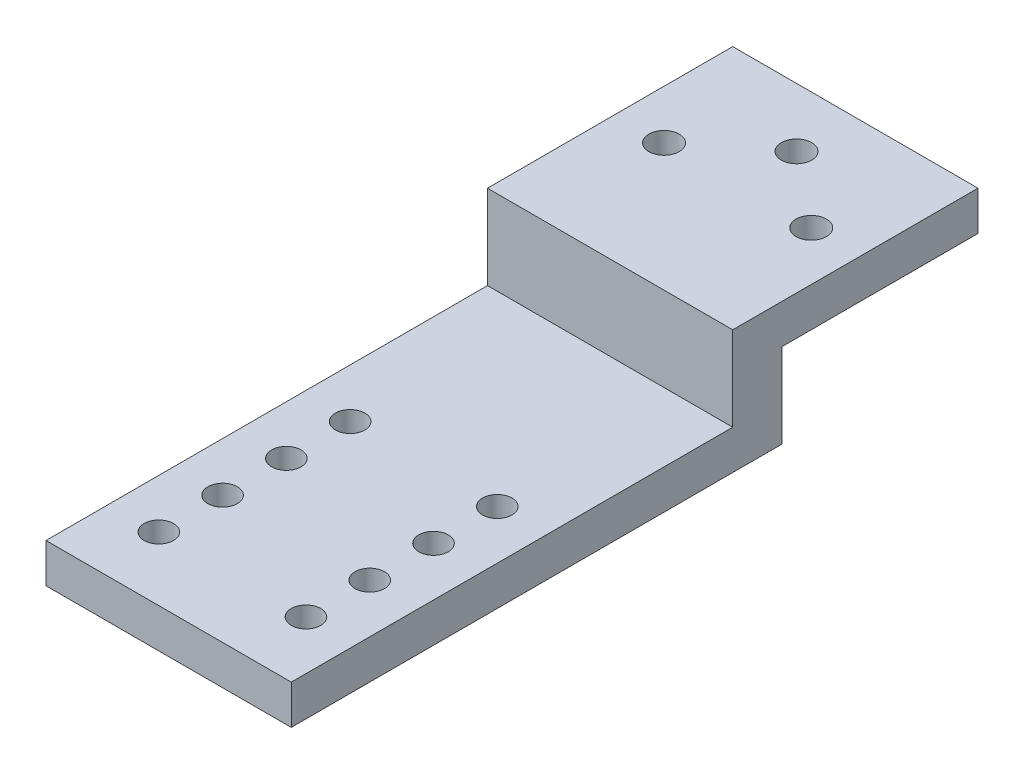
ISO-10303-21;
HEADER;
FILE_DESCRIPTION(('STEP AP214'),'2;1');
FILE_NAME('part.step','',(''),(''),'','','');
FILE_SCHEMA(('AUTOMOTIVE_DESIGN { 1 0 10303 214 1 1 1 1 }'));
ENDSEC;
DATA;
#1=APPLICATION_CONTEXT('core data for automotive mechanical design processes');
#2=APPLICATION_PROTOCOL_DEFINITION('international standard','automotive_design',2000,#1);
#3=PRODUCT_CONTEXT('',#1,'mechanical');
#4=PRODUCT('Part','Part','',(#3));
#5=PRODUCT_RELATED_PRODUCT_CATEGORY('part','',(#4));
#6=PRODUCT_DEFINITION_FORMATION('','',#4);
#7=PRODUCT_DEFINITION_CONTEXT('part definition',#1,'design');
#8=PRODUCT_DEFINITION('design','',#6,#7);
#9=PRODUCT_DEFINITION_SHAPE('','',#8);
#10=(LENGTH_UNIT() NAMED_UNIT(*) SI_UNIT(.MILLI.,.METRE.));
#11=(NAMED_UNIT(*) PLANE_ANGLE_UNIT() SI_UNIT($,.RADIAN.));
#12=(NAMED_UNIT(*) SI_UNIT($,.STERADIAN.) SOLID_ANGLE_UNIT());
#13=UNCERTAINTY_MEASURE_WITH_UNIT(LENGTH_MEASURE(1.E-05),#10,'distance_accuracy_value','');
#14=(GEOMETRIC_REPRESENTATION_CONTEXT(3) GLOBAL_UNCERTAINTY_ASSIGNED_CONTEXT((#13)) GLOBAL_UNIT_ASSIGNED_CONTEXT((#10,
#11,#12)) REPRESENTATION_CONTEXT('',''));
#15=CARTESIAN_POINT('',(0.,0.,0.));
#16=DIRECTION('',(0.,0.,1.));
#17=DIRECTION('',(1.,0.,0.));
#18=AXIS2_PLACEMENT_3D('',#15,#16,#17);
#19=CARTESIAN_POINT('',(0.,4.,0.));
#20=DIRECTION('',(0.,1.,0.));
#21=DIRECTION('',(0.,0.,1.));
#22=AXIS2_PLACEMENT_3D('',#19,#20,#21);
#23=PLANE('',#22);
#24=DIRECTION('',(1.,0.,0.));
#25=VECTOR('',#24,1.);
#26=CARTESIAN_POINT('',(-12.5,4.,-23.8522336769759));
#27=LINE('',#26,#25);
#28=CARTESIAN_POINT('',(-12.5,4.,-23.8522336769759));
#29=VERTEX_POINT('',#28);
#30=CARTESIAN_POINT('',(12.5,4.,-23.8522336769759));
#31=VERTEX_POINT('',#30);
#32=EDGE_CURVE('E58',#29,#31,#27,.T.);
#33=ORIENTED_EDGE('',*,*,#32,.F.);
#34=DIRECTION('',(0.,0.,1.));
#35=VECTOR('',#34,1.);
#36=CARTESIAN_POINT('',(-12.5,4.,-48.8522336769759));
#37=LINE('',#36,#35);
#38=CARTESIAN_POINT('',(-12.5,4.,21.1477663230241));
#39=VERTEX_POINT('',#38);
#40=EDGE_CURVE('E188',#29,#39,#37,.T.);
#41=ORIENTED_EDGE('',*,*,#40,.T.);
#42=DIRECTION('',(1.,0.,0.));
#43=VECTOR('',#42,1.);
#44=CARTESIAN_POINT('',(-12.5,4.,21.1477663230241));
#45=LINE('',#44,#43);
#46=CARTESIAN_POINT('',(12.5,4.,21.1477663230241));
#47=VERTEX_POINT('',#46);
#48=EDGE_CURVE('E190',#39,#47,#45,.T.);
#49=ORIENTED_EDGE('',*,*,#48,.T.);
#50=DIRECTION('',(0.,0.,-1.));
#51=VECTOR('',#50,1.);
#52=CARTESIAN_POINT('',(12.5,4.,21.1477663230241));
#53=LINE('',#52,#51);
#54=EDGE_CURVE('E193',#47,#31,#53,.T.);
#55=ORIENTED_EDGE('',*,*,#54,.T.);
#56=EDGE_LOOP('',(#33,#41,#49,#55));
#57=FACE_BOUND('',#56,.T.);
#58=CARTESIAN_POINT('',(-7.5,4.,-4.85223367697595));
#59=DIRECTION('',(0.,1.,0.));
#60=DIRECTION('',(0.,0.,1.));
#61=AXIS2_PLACEMENT_3D('',#58,#59,#60);
#62=CIRCLE('',#61,1.5);
#63=CARTESIAN_POINT('',(-7.5,4.,-3.35223367697595));
#64=VERTEX_POINT('',#63);
#65=EDGE_CURVE('E146',#64,#64,#62,.T.);
#66=ORIENTED_EDGE('',*,*,#65,.F.);
#67=EDGE_LOOP('',(#66));
#68=FACE_BOUND('',#67,.T.);
#69=CARTESIAN_POINT('',(-7.5,4.,1.64776632302405));
#70=DIRECTION('',(0.,1.,0.));
#71=DIRECTION('',(0.,0.,1.));
#72=AXIS2_PLACEMENT_3D('',#69,#70,#71);
#73=CIRCLE('',#72,1.5);
#74=CARTESIAN_POINT('',(-7.5,4.,3.14776632302405));
#75=VERTEX_POINT('',#74);
#76=EDGE_CURVE('E158',#75,#75,#73,.T.);
#77=ORIENTED_EDGE('',*,*,#76,.F.);
#78=EDGE_LOOP('',(#77));
#79=FACE_BOUND('',#78,.T.);
#80=CARTESIAN_POINT('',(-7.5,4.,8.14776632302405));
#81=DIRECTION('',(0.,1.,0.));
#82=DIRECTION('',(0.,0.,1.));
#83=AXIS2_PLACEMENT_3D('',#80,#81,#82);
#84=CIRCLE('',#83,1.5);
#85=CARTESIAN_POINT('',(-7.5,4.,9.64776632302405));
#86=VERTEX_POINT('',#85);
#87=EDGE_CURVE('E170',#86,#86,#84,.T.);
#88=ORIENTED_EDGE('',*,*,#87,.F.);
#89=EDGE_LOOP('',(#88));
#90=FACE_BOUND('',#89,.T.);
#91=CARTESIAN_POINT('',(-7.5,4.,14.6477663230241));
#92=DIRECTION('',(0.,1.,0.));
#93=DIRECTION('',(0.,0.,1.));
#94=AXIS2_PLACEMENT_3D('',#91,#92,#93);
#95=CIRCLE('',#94,1.5);
#96=CARTESIAN_POINT('',(-7.5,4.,16.1477663230241));
#97=VERTEX_POINT('',#96);
#98=EDGE_CURVE('E182',#97,#97,#95,.T.);
#99=ORIENTED_EDGE('',*,*,#98,.F.);
#100=EDGE_LOOP('',(#99));
#101=FACE_BOUND('',#100,.T.);
#102=CARTESIAN_POINT('',(7.5,4.,14.6477663230241));
#103=DIRECTION('',(0.,1.,0.));
#104=DIRECTION('',(0.,0.,1.));
#105=AXIS2_PLACEMENT_3D('',#102,#103,#104);
#106=CIRCLE('',#105,1.5);
#107=CARTESIAN_POINT('',(7.5,4.,16.1477663230241));
#108=VERTEX_POINT('',#107);
#109=EDGE_CURVE('E176',#108,#108,#106,.T.);
#110=ORIENTED_EDGE('',*,*,#109,.F.);
#111=EDGE_LOOP('',(#110));
#112=FACE_BOUND('',#111,.T.);
#113=CARTESIAN_POINT('',(7.5,4.,8.14776632302406));
#114=DIRECTION('',(0.,1.,0.));
#115=DIRECTION('',(0.,0.,1.));
#116=AXIS2_PLACEMENT_3D('',#113,#114,#115);
#117=CIRCLE('',#116,1.5);
#118=CARTESIAN_POINT('',(7.5,4.,9.64776632302406));
#119=VERTEX_POINT('',#118);
#120=EDGE_CURVE('E164',#119,#119,#117,.T.);
#121=ORIENTED_EDGE('',*,*,#120,.F.);
#122=EDGE_LOOP('',(#121));
#123=FACE_BOUND('',#122,.T.);
#124=CARTESIAN_POINT('',(7.5,4.,1.64776632302405));
#125=DIRECTION('',(0.,1.,0.));
#126=DIRECTION('',(0.,0.,1.));
#127=AXIS2_PLACEMENT_3D('',#124,#125,#126);
#128=CIRCLE('',#127,1.5);
#129=CARTESIAN_POINT('',(7.5,4.,3.14776632302405));
#130=VERTEX_POINT('',#129);
#131=EDGE_CURVE('E152',#130,#130,#128,.T.);
#132=ORIENTED_EDGE('',*,*,#131,.F.);
#133=EDGE_LOOP('',(#132));
#134=FACE_BOUND('',#133,.T.);
#135=CARTESIAN_POINT('',(7.5,4.,-4.85223367697595));
#136=DIRECTION('',(0.,1.,0.));
#137=DIRECTION('',(0.,0.,1.));
#138=AXIS2_PLACEMENT_3D('',#135,#136,#137);
#139=CIRCLE('',#138,1.5);
#140=CARTESIAN_POINT('',(7.5,4.,-3.35223367697595));
#141=VERTEX_POINT('',#140);
#142=EDGE_CURVE('E140',#141,#141,#139,.T.);
#143=ORIENTED_EDGE('',*,*,#142,.F.);
#144=EDGE_LOOP('',(#143));
#145=FACE_BOUND('',#144,.T.);
#146=ADVANCED_FACE('F35',(#57,#68,#79,#90,#101,#112,#123,#134,#145),#23,.T.);
#147=CARTESIAN_POINT('',(0.,0.,0.));
#148=DIRECTION('',(0.,1.,0.));
#149=DIRECTION('',(0.,0.,1.));
#150=AXIS2_PLACEMENT_3D('',#147,#148,#149);
#151=PLANE('',#150);
#152=DIRECTION('',(0.,0.,1.));
#153=VECTOR('',#152,1.);
#154=CARTESIAN_POINT('',(-12.5,0.,-48.8522336769759));
#155=LINE('',#154,#153);
#156=CARTESIAN_POINT('',(-12.5,0.,-28.8522336769759));
#157=VERTEX_POINT('',#156);
#158=CARTESIAN_POINT('',(-12.5,0.,21.1477663230241));
#159=VERTEX_POINT('',#158);
#160=EDGE_CURVE('E185',#157,#159,#155,.T.);
#161=ORIENTED_EDGE('',*,*,#160,.F.);
#162=DIRECTION('',(-1.,0.,0.));
#163=VECTOR('',#162,1.);
#164=CARTESIAN_POINT('',(-12.5,0.,-28.8522336769759));
#165=LINE('',#164,#163);
#166=CARTESIAN_POINT('',(12.5,0.,-28.8522336769759));
#167=VERTEX_POINT('',#166);
#168=EDGE_CURVE('E105',#167,#157,#165,.T.);
#169=ORIENTED_EDGE('',*,*,#168,.F.);
#170=DIRECTION('',(0.,0.,-1.));
#171=VECTOR('',#170,1.);
#172=CARTESIAN_POINT('',(12.5,0.,21.1477663230241));
#173=LINE('',#172,#171);
#174=CARTESIAN_POINT('',(12.5,0.,21.1477663230241));
#175=VERTEX_POINT('',#174);
#176=EDGE_CURVE('E191',#175,#167,#173,.T.);
#177=ORIENTED_EDGE('',*,*,#176,.F.);
#178=DIRECTION('',(1.,0.,0.));
#179=VECTOR('',#178,1.);
#180=CARTESIAN_POINT('',(-12.5,0.,21.1477663230241));
#181=LINE('',#180,#179);
#182=EDGE_CURVE('E196',#159,#175,#181,.T.);
#183=ORIENTED_EDGE('',*,*,#182,.F.);
#184=EDGE_LOOP('',(#161,#169,#177,#183));
#185=FACE_BOUND('',#184,.T.);
#186=CARTESIAN_POINT('',(-7.5,0.,14.6477663230241));
#187=DIRECTION('',(0.,1.,0.));
#188=DIRECTION('',(0.,0.,1.));
#189=AXIS2_PLACEMENT_3D('',#186,#187,#188);
#190=CIRCLE('',#189,1.5);
#191=CARTESIAN_POINT('',(-7.5,0.,16.1477663230241));
#192=VERTEX_POINT('',#191);
#193=EDGE_CURVE('E179',#192,#192,#190,.T.);
#194=ORIENTED_EDGE('',*,*,#193,.T.);
#195=EDGE_LOOP('',(#194));
#196=FACE_BOUND('',#195,.T.);
#197=CARTESIAN_POINT('',(7.5,0.,14.6477663230241));
#198=DIRECTION('',(0.,1.,0.));
#199=DIRECTION('',(0.,0.,1.));
#200=AXIS2_PLACEMENT_3D('',#197,#198,#199);
#201=CIRCLE('',#200,1.5);
#202=CARTESIAN_POINT('',(7.5,0.,16.1477663230241));
#203=VERTEX_POINT('',#202);
#204=EDGE_CURVE('E173',#203,#203,#201,.T.);
#205=ORIENTED_EDGE('',*,*,#204,.T.);
#206=EDGE_LOOP('',(#205));
#207=FACE_BOUND('',#206,.T.);
#208=CARTESIAN_POINT('',(-7.5,0.,8.14776632302405));
#209=DIRECTION('',(0.,1.,0.));
#210=DIRECTION('',(0.,0.,1.));
#211=AXIS2_PLACEMENT_3D('',#208,#209,#210);
#212=CIRCLE('',#211,1.5);
#213=CARTESIAN_POINT('',(-7.5,0.,9.64776632302405));
#214=VERTEX_POINT('',#213);
#215=EDGE_CURVE('E167',#214,#214,#212,.T.);
#216=ORIENTED_EDGE('',*,*,#215,.T.);
#217=EDGE_LOOP('',(#216));
#218=FACE_BOUND('',#217,.T.);
#219=CARTESIAN_POINT('',(7.5,0.,8.14776632302406));
#220=DIRECTION('',(0.,1.,0.));
#221=DIRECTION('',(0.,0.,1.));
#222=AXIS2_PLACEMENT_3D('',#219,#220,#221);
#223=CIRCLE('',#222,1.5);
#224=CARTESIAN_POINT('',(7.5,0.,9.64776632302406));
#225=VERTEX_POINT('',#224);
#226=EDGE_CURVE('E161',#225,#225,#223,.T.);
#227=ORIENTED_EDGE('',*,*,#226,.T.);
#228=EDGE_LOOP('',(#227));
#229=FACE_BOUND('',#228,.T.);
#230=CARTESIAN_POINT('',(-7.5,0.,1.64776632302405));
#231=DIRECTION('',(0.,1.,0.));
#232=DIRECTION('',(0.,0.,1.));
#233=AXIS2_PLACEMENT_3D('',#230,#231,#232);
#234=CIRCLE('',#233,1.5);
#235=CARTESIAN_POINT('',(-7.5,0.,3.14776632302405));
#236=VERTEX_POINT('',#235);
#237=EDGE_CURVE('E155',#236,#236,#234,.T.);
#238=ORIENTED_EDGE('',*,*,#237,.T.);
#239=EDGE_LOOP('',(#238));
#240=FACE_BOUND('',#239,.T.);
#241=CARTESIAN_POINT('',(7.5,0.,1.64776632302405));
#242=DIRECTION('',(0.,1.,0.));
#243=DIRECTION('',(0.,0.,1.));
#244=AXIS2_PLACEMENT_3D('',#241,#242,#243);
#245=CIRCLE('',#244,1.5);
#246=CARTESIAN_POINT('',(7.5,0.,3.14776632302405));
#247=VERTEX_POINT('',#246);
#248=EDGE_CURVE('E149',#247,#247,#245,.T.);
#249=ORIENTED_EDGE('',*,*,#248,.T.);
#250=EDGE_LOOP('',(#249));
#251=FACE_BOUND('',#250,.T.);
#252=CARTESIAN_POINT('',(-7.5,0.,-4.85223367697595));
#253=DIRECTION('',(0.,1.,0.));
#254=DIRECTION('',(0.,0.,1.));
#255=AXIS2_PLACEMENT_3D('',#252,#253,#254);
#256=CIRCLE('',#255,1.5);
#257=CARTESIAN_POINT('',(-7.5,0.,-3.35223367697595));
#258=VERTEX_POINT('',#257);
#259=EDGE_CURVE('E143',#258,#258,#256,.T.);
#260=ORIENTED_EDGE('',*,*,#259,.T.);
#261=EDGE_LOOP('',(#260));
#262=FACE_BOUND('',#261,.T.);
#263=CARTESIAN_POINT('',(7.5,0.,-4.85223367697595));
#264=DIRECTION('',(0.,1.,0.));
#265=DIRECTION('',(0.,0.,1.));
#266=AXIS2_PLACEMENT_3D('',#263,#264,#265);
#267=CIRCLE('',#266,1.5);
#268=CARTESIAN_POINT('',(7.5,0.,-3.35223367697595));
#269=VERTEX_POINT('',#268);
#270=EDGE_CURVE('E139',#269,#269,#267,.T.);
#271=ORIENTED_EDGE('',*,*,#270,.T.);
#272=EDGE_LOOP('',(#271));
#273=FACE_BOUND('',#272,.T.);
#274=ADVANCED_FACE('F213',(#185,#196,#207,#218,#229,#240,#251,#262,#273),#151,.F.);
#275=CARTESIAN_POINT('',(-12.5,4.,-48.8522336769759));
#276=DIRECTION('',(0.,0.,1.));
#277=DIRECTION('',(1.,0.,0.));
#278=AXIS2_PLACEMENT_3D('',#275,#276,#277);
#279=PLANE('',#278);
#280=DIRECTION('',(0.,-1.,0.));
#281=VECTOR('',#280,1.);
#282=CARTESIAN_POINT('',(12.5,4.,-48.8522336769759));
#283=LINE('',#282,#281);
#284=CARTESIAN_POINT('',(12.5,12.6,-48.8522336769759));
#285=VERTEX_POINT('',#284);
#286=CARTESIAN_POINT('',(12.5,8.6,-48.8522336769759));
#287=VERTEX_POINT('',#286);
#288=EDGE_CURVE('E111',#285,#287,#283,.T.);
#289=ORIENTED_EDGE('',*,*,#288,.T.);
#290=DIRECTION('',(1.,0.,0.));
#291=VECTOR('',#290,1.);
#292=CARTESIAN_POINT('',(-12.5,8.6,-48.8522336769759));
#293=LINE('',#292,#291);
#294=CARTESIAN_POINT('',(-12.5,8.6,-48.8522336769759));
#295=VERTEX_POINT('',#294);
#296=EDGE_CURVE('E50',#295,#287,#293,.T.);
#297=ORIENTED_EDGE('',*,*,#296,.F.);
#298=DIRECTION('',(0.,-1.,0.));
#299=VECTOR('',#298,1.);
#300=CARTESIAN_POINT('',(-12.5,4.,-48.8522336769759));
#301=LINE('',#300,#299);
#302=CARTESIAN_POINT('',(-12.5,12.6,-48.8522336769759));
#303=VERTEX_POINT('',#302);
#304=EDGE_CURVE('E11',#303,#295,#301,.T.);
#305=ORIENTED_EDGE('',*,*,#304,.F.);
#306=DIRECTION('',(-1.,0.,0.));
#307=VECTOR('',#306,1.);
#308=CARTESIAN_POINT('',(-12.5,12.6,-48.8522336769759));
#309=LINE('',#308,#307);
#310=EDGE_CURVE('E133',#285,#303,#309,.T.);
#311=ORIENTED_EDGE('',*,*,#310,.F.);
#312=EDGE_LOOP('',(#289,#297,#305,#311));
#313=FACE_BOUND('',#312,.T.);
#314=ADVANCED_FACE('F37',(#313),#279,.F.);
#315=CARTESIAN_POINT('',(-12.5,4.,-48.8522336769759));
#316=DIRECTION('',(1.,0.,0.));
#317=DIRECTION('',(0.,0.,-1.));
#318=AXIS2_PLACEMENT_3D('',#315,#316,#317);
#319=PLANE('',#318);
#320=DIRECTION('',(0.,0.,-1.));
#321=VECTOR('',#320,1.);
#322=CARTESIAN_POINT('',(-12.5,8.6,-48.8522336769759));
#323=LINE('',#322,#321);
#324=CARTESIAN_POINT('',(-12.5,8.6,-28.8522336769759));
#325=VERTEX_POINT('',#324);
#326=EDGE_CURVE('E99',#325,#295,#323,.T.);
#327=ORIENTED_EDGE('',*,*,#326,.F.);
#328=DIRECTION('',(0.,-1.,0.));
#329=VECTOR('',#328,1.);
#330=CARTESIAN_POINT('',(-12.5,8.6,-28.8522336769759));
#331=LINE('',#330,#329);
#332=EDGE_CURVE('E233',#325,#157,#331,.T.);
#333=ORIENTED_EDGE('',*,*,#332,.T.);
#334=ORIENTED_EDGE('',*,*,#160,.T.);
#335=DIRECTION('',(0.,-1.,0.));
#336=VECTOR('',#335,1.);
#337=CARTESIAN_POINT('',(-12.5,4.,21.1477663230241));
#338=LINE('',#337,#336);
#339=EDGE_CURVE('E43',#39,#159,#338,.T.);
#340=ORIENTED_EDGE('',*,*,#339,.F.);
#341=ORIENTED_EDGE('',*,*,#40,.F.);
#342=DIRECTION('',(0.,-1.,0.));
#343=VECTOR('',#342,1.);
#344=CARTESIAN_POINT('',(-12.5,12.6,-23.8522336769759));
#345=LINE('',#344,#343);
#346=CARTESIAN_POINT('',(-12.5,12.6,-23.8522336769759));
#347=VERTEX_POINT('',#346);
#348=EDGE_CURVE('E120',#347,#29,#345,.T.);
#349=ORIENTED_EDGE('',*,*,#348,.F.);
#350=DIRECTION('',(0.,0.,1.));
#351=VECTOR('',#350,1.);
#352=CARTESIAN_POINT('',(-12.5,12.6,-48.8522336769759));
#353=LINE('',#352,#351);
#354=EDGE_CURVE('E118',#303,#347,#353,.T.);
#355=ORIENTED_EDGE('',*,*,#354,.F.);
#356=ORIENTED_EDGE('',*,*,#304,.T.);
#357=EDGE_LOOP('',(#327,#333,#334,#340,#341,#349,#355,#356));
#358=FACE_BOUND('',#357,.T.);
#359=ADVANCED_FACE('F115',(#358),#319,.F.);
#360=CARTESIAN_POINT('',(-12.5,4.,21.1477663230241));
#361=DIRECTION('',(0.,0.,-1.));
#362=DIRECTION('',(-1.,0.,0.));
#363=AXIS2_PLACEMENT_3D('',#360,#361,#362);
#364=PLANE('',#363);
#365=ORIENTED_EDGE('',*,*,#182,.T.);
#366=DIRECTION('',(0.,-1.,0.));
#367=VECTOR('',#366,1.);
#368=CARTESIAN_POINT('',(12.5,4.,21.1477663230241));
#369=LINE('',#368,#367);
#370=EDGE_CURVE('E201',#47,#175,#369,.T.);
#371=ORIENTED_EDGE('',*,*,#370,.F.);
#372=ORIENTED_EDGE('',*,*,#48,.F.);
#373=ORIENTED_EDGE('',*,*,#339,.T.);
#374=EDGE_LOOP('',(#365,#371,#372,#373));
#375=FACE_BOUND('',#374,.T.);
#376=ADVANCED_FACE('F208',(#375),#364,.F.);
#377=CARTESIAN_POINT('',(12.5,4.,21.1477663230241));
#378=DIRECTION('',(-1.,0.,0.));
#379=DIRECTION('',(0.,0.,1.));
#380=AXIS2_PLACEMENT_3D('',#377,#378,#379);
#381=PLANE('',#380);
#382=ORIENTED_EDGE('',*,*,#176,.T.);
#383=DIRECTION('',(0.,-1.,0.));
#384=VECTOR('',#383,1.);
#385=CARTESIAN_POINT('',(12.5,8.6,-28.8522336769759));
#386=LINE('',#385,#384);
#387=CARTESIAN_POINT('',(12.5,8.6,-28.8522336769759));
#388=VERTEX_POINT('',#387);
#389=EDGE_CURVE('E219',#388,#167,#386,.T.);
#390=ORIENTED_EDGE('',*,*,#389,.F.);
#391=DIRECTION('',(0.,0.,1.));
#392=VECTOR('',#391,1.);
#393=CARTESIAN_POINT('',(12.5,8.6,-48.8522336769759));
#394=LINE('',#393,#392);
#395=EDGE_CURVE('E112',#287,#388,#394,.T.);
#396=ORIENTED_EDGE('',*,*,#395,.F.);
#397=ORIENTED_EDGE('',*,*,#288,.F.);
#398=DIRECTION('',(0.,0.,-1.));
#399=VECTOR('',#398,1.);
#400=CARTESIAN_POINT('',(12.5,12.6,-48.8522336769759));
#401=LINE('',#400,#399);
#402=CARTESIAN_POINT('',(12.5,12.6,-23.8522336769759));
#403=VERTEX_POINT('',#402);
#404=EDGE_CURVE('E124',#403,#285,#401,.T.);
#405=ORIENTED_EDGE('',*,*,#404,.F.);
#406=DIRECTION('',(0.,-1.,0.));
#407=VECTOR('',#406,1.);
#408=CARTESIAN_POINT('',(12.5,12.6,-23.8522336769759));
#409=LINE('',#408,#407);
#410=EDGE_CURVE('E134',#403,#31,#409,.T.);
#411=ORIENTED_EDGE('',*,*,#410,.T.);
#412=ORIENTED_EDGE('',*,*,#54,.F.);
#413=ORIENTED_EDGE('',*,*,#370,.T.);
#414=EDGE_LOOP('',(#382,#390,#396,#397,#405,#411,#412,#413));
#415=FACE_BOUND('',#414,.T.);
#416=ADVANCED_FACE('F218',(#415),#381,.F.);
#417=CARTESIAN_POINT('',(-7.5,4.,-36.8522336769759));
#418=DIRECTION('',(0.,-1.,0.));
#419=DIRECTION('',(0.,0.,-1.));
#420=AXIS2_PLACEMENT_3D('',#417,#418,#419);
#421=CYLINDRICAL_SURFACE('',#420,1.55);
#422=CARTESIAN_POINT('',(-7.5,8.6,-36.8522336769759));
#423=DIRECTION('',(0.,-1.,0.));
#424=DIRECTION('',(0.,0.,-1.));
#425=AXIS2_PLACEMENT_3D('',#422,#423,#424);
#426=CIRCLE('',#425,1.55);
#427=CARTESIAN_POINT('',(-7.5,8.6,-38.4022336769759));
#428=VERTEX_POINT('',#427);
#429=EDGE_CURVE('E232',#428,#428,#426,.T.);
#430=ORIENTED_EDGE('',*,*,#429,.T.);
#431=EDGE_LOOP('',(#430));
#432=FACE_BOUND('',#431,.T.);
#433=CARTESIAN_POINT('',(-7.5,12.6,-36.8522336769759));
#434=DIRECTION('',(0.,1.,0.));
#435=DIRECTION('',(0.,0.,1.));
#436=AXIS2_PLACEMENT_3D('',#433,#434,#435);
#437=CIRCLE('',#436,1.55);
#438=CARTESIAN_POINT('',(-7.5,12.6,-35.3022336769759));
#439=VERTEX_POINT('',#438);
#440=EDGE_CURVE('E235',#439,#439,#437,.T.);
#441=ORIENTED_EDGE('',*,*,#440,.T.);
#442=EDGE_LOOP('',(#441));
#443=FACE_BOUND('',#442,.T.);
#444=ADVANCED_FACE('F252',(#432,#443),#421,.F.);
#445=CARTESIAN_POINT('',(-7.5,4.,14.6477663230241));
#446=DIRECTION('',(0.,-1.,0.));
#447=DIRECTION('',(0.,0.,-1.));
#448=AXIS2_PLACEMENT_3D('',#445,#446,#447);
#449=CYLINDRICAL_SURFACE('',#448,1.5);
#450=ORIENTED_EDGE('',*,*,#98,.T.);
#451=EDGE_LOOP('',(#450));
#452=FACE_BOUND('',#451,.T.);
#453=ORIENTED_EDGE('',*,*,#193,.F.);
#454=EDGE_LOOP('',(#453));
#455=FACE_BOUND('',#454,.T.);
#456=ADVANCED_FACE('F254',(#452,#455),#449,.F.);
#457=CARTESIAN_POINT('',(7.5,4.,14.6477663230241));
#458=DIRECTION('',(0.,-1.,0.));
#459=DIRECTION('',(0.,0.,-1.));
#460=AXIS2_PLACEMENT_3D('',#457,#458,#459);
#461=CYLINDRICAL_SURFACE('',#460,1.5);
#462=ORIENTED_EDGE('',*,*,#109,.T.);
#463=EDGE_LOOP('',(#462));
#464=FACE_BOUND('',#463,.T.);
#465=ORIENTED_EDGE('',*,*,#204,.F.);
#466=EDGE_LOOP('',(#465));
#467=FACE_BOUND('',#466,.T.);
#468=ADVANCED_FACE('F262',(#464,#467),#461,.F.);
#469=CARTESIAN_POINT('',(-7.5,4.,8.14776632302405));
#470=DIRECTION('',(0.,-1.,0.));
#471=DIRECTION('',(0.,0.,-1.));
#472=AXIS2_PLACEMENT_3D('',#469,#470,#471);
#473=CYLINDRICAL_SURFACE('',#472,1.5);
#474=ORIENTED_EDGE('',*,*,#87,.T.);
#475=EDGE_LOOP('',(#474));
#476=FACE_BOUND('',#475,.T.);
#477=ORIENTED_EDGE('',*,*,#215,.F.);
#478=EDGE_LOOP('',(#477));
#479=FACE_BOUND('',#478,.T.);
#480=ADVANCED_FACE('F322',(#476,#479),#473,.F.);
#481=CARTESIAN_POINT('',(7.5,4.,8.14776632302406));
#482=DIRECTION('',(0.,-1.,0.));
#483=DIRECTION('',(0.,0.,-1.));
#484=AXIS2_PLACEMENT_3D('',#481,#482,#483);
#485=CYLINDRICAL_SURFACE('',#484,1.5);
#486=ORIENTED_EDGE('',*,*,#120,.T.);
#487=EDGE_LOOP('',(#486));
#488=FACE_BOUND('',#487,.T.);
#489=ORIENTED_EDGE('',*,*,#226,.F.);
#490=EDGE_LOOP('',(#489));
#491=FACE_BOUND('',#490,.T.);
#492=ADVANCED_FACE('F314',(#488,#491),#485,.F.);
#493=CARTESIAN_POINT('',(-7.5,4.,1.64776632302405));
#494=DIRECTION('',(0.,-1.,0.));
#495=DIRECTION('',(0.,0.,-1.));
#496=AXIS2_PLACEMENT_3D('',#493,#494,#495);
#497=CYLINDRICAL_SURFACE('',#496,1.5);
#498=ORIENTED_EDGE('',*,*,#76,.T.);
#499=EDGE_LOOP('',(#498));
#500=FACE_BOUND('',#499,.T.);
#501=ORIENTED_EDGE('',*,*,#237,.F.);
#502=EDGE_LOOP('',(#501));
#503=FACE_BOUND('',#502,.T.);
#504=ADVANCED_FACE('F306',(#500,#503),#497,.F.);
#505=CARTESIAN_POINT('',(7.5,4.,1.64776632302405));
#506=DIRECTION('',(0.,-1.,0.));
#507=DIRECTION('',(0.,0.,-1.));
#508=AXIS2_PLACEMENT_3D('',#505,#506,#507);
#509=CYLINDRICAL_SURFACE('',#508,1.5);
#510=ORIENTED_EDGE('',*,*,#131,.T.);
#511=EDGE_LOOP('',(#510));
#512=FACE_BOUND('',#511,.T.);
#513=ORIENTED_EDGE('',*,*,#248,.F.);
#514=EDGE_LOOP('',(#513));
#515=FACE_BOUND('',#514,.T.);
#516=ADVANCED_FACE('F298',(#512,#515),#509,.F.);
#517=CARTESIAN_POINT('',(-7.5,4.,-4.85223367697595));
#518=DIRECTION('',(0.,-1.,0.));
#519=DIRECTION('',(0.,0.,-1.));
#520=AXIS2_PLACEMENT_3D('',#517,#518,#519);
#521=CYLINDRICAL_SURFACE('',#520,1.5);
#522=ORIENTED_EDGE('',*,*,#65,.T.);
#523=EDGE_LOOP('',(#522));
#524=FACE_BOUND('',#523,.T.);
#525=ORIENTED_EDGE('',*,*,#259,.F.);
#526=EDGE_LOOP('',(#525));
#527=FACE_BOUND('',#526,.T.);
#528=ADVANCED_FACE('F290',(#524,#527),#521,.F.);
#529=CARTESIAN_POINT('',(7.5,4.,-4.85223367697595));
#530=DIRECTION('',(0.,-1.,0.));
#531=DIRECTION('',(0.,0.,-1.));
#532=AXIS2_PLACEMENT_3D('',#529,#530,#531);
#533=CYLINDRICAL_SURFACE('',#532,1.5);
#534=ORIENTED_EDGE('',*,*,#142,.T.);
#535=EDGE_LOOP('',(#534));
#536=FACE_BOUND('',#535,.T.);
#537=ORIENTED_EDGE('',*,*,#270,.F.);
#538=EDGE_LOOP('',(#537));
#539=FACE_BOUND('',#538,.T.);
#540=ADVANCED_FACE('F286',(#536,#539),#533,.F.);
#541=CARTESIAN_POINT('',(7.5,4.,-36.8522336769759));
#542=DIRECTION('',(0.,-1.,0.));
#543=DIRECTION('',(0.,0.,-1.));
#544=AXIS2_PLACEMENT_3D('',#541,#542,#543);
#545=CYLINDRICAL_SURFACE('',#544,1.55);
#546=CARTESIAN_POINT('',(7.5,8.6,-36.8522336769759));
#547=DIRECTION('',(0.,-1.,0.));
#548=DIRECTION('',(0.,0.,-1.));
#549=AXIS2_PLACEMENT_3D('',#546,#547,#548);
#550=CIRCLE('',#549,1.55);
#551=CARTESIAN_POINT('',(7.5,8.6,-38.4022336769759));
#552=VERTEX_POINT('',#551);
#553=EDGE_CURVE('E458',#552,#552,#550,.T.);
#554=ORIENTED_EDGE('',*,*,#553,.T.);
#555=EDGE_LOOP('',(#554));
#556=FACE_BOUND('',#555,.T.);
#557=CARTESIAN_POINT('',(7.5,12.6,-36.8522336769759));
#558=DIRECTION('',(0.,1.,0.));
#559=DIRECTION('',(0.,0.,1.));
#560=AXIS2_PLACEMENT_3D('',#557,#558,#559);
#561=CIRCLE('',#560,1.55);
#562=CARTESIAN_POINT('',(7.5,12.6,-35.3022336769759));
#563=VERTEX_POINT('',#562);
#564=EDGE_CURVE('E238',#563,#563,#561,.T.);
#565=ORIENTED_EDGE('',*,*,#564,.T.);
#566=EDGE_LOOP('',(#565));
#567=FACE_BOUND('',#566,.T.);
#568=ADVANCED_FACE('F289',(#556,#567),#545,.F.);
#569=CARTESIAN_POINT('',(0.,4.,-42.8522336769759));
#570=DIRECTION('',(0.,-1.,0.));
#571=DIRECTION('',(0.,0.,-1.));
#572=AXIS2_PLACEMENT_3D('',#569,#570,#571);
#573=CYLINDRICAL_SURFACE('',#572,1.55);
#574=CARTESIAN_POINT('',(0.,8.6,-42.8522336769759));
#575=DIRECTION('',(0.,-1.,0.));
#576=DIRECTION('',(0.,0.,-1.));
#577=AXIS2_PLACEMENT_3D('',#574,#575,#576);
#578=CIRCLE('',#577,1.55);
#579=CARTESIAN_POINT('',(0.,8.6,-44.4022336769759));
#580=VERTEX_POINT('',#579);
#581=EDGE_CURVE('E455',#580,#580,#578,.T.);
#582=ORIENTED_EDGE('',*,*,#581,.T.);
#583=EDGE_LOOP('',(#582));
#584=FACE_BOUND('',#583,.T.);
#585=CARTESIAN_POINT('',(0.,12.6,-42.8522336769759));
#586=DIRECTION('',(0.,1.,0.));
#587=DIRECTION('',(0.,0.,1.));
#588=AXIS2_PLACEMENT_3D('',#585,#586,#587);
#589=CIRCLE('',#588,1.55);
#590=CARTESIAN_POINT('',(0.,12.6,-41.3022336769759));
#591=VERTEX_POINT('',#590);
#592=EDGE_CURVE('E126',#591,#591,#589,.T.);
#593=ORIENTED_EDGE('',*,*,#592,.T.);
#594=EDGE_LOOP('',(#593));
#595=FACE_BOUND('',#594,.T.);
#596=ADVANCED_FACE('F245',(#584,#595),#573,.F.);
#597=CARTESIAN_POINT('',(0.,12.6,0.));
#598=DIRECTION('',(0.,1.,0.));
#599=DIRECTION('',(0.,0.,1.));
#600=AXIS2_PLACEMENT_3D('',#597,#598,#599);
#601=PLANE('',#600);
#602=ORIENTED_EDGE('',*,*,#564,.F.);
#603=EDGE_LOOP('',(#602));
#604=FACE_BOUND('',#603,.T.);
#605=ORIENTED_EDGE('',*,*,#354,.T.);
#606=DIRECTION('',(1.,0.,0.));
#607=VECTOR('',#606,1.);
#608=CARTESIAN_POINT('',(-12.5,12.6,-23.8522336769759));
#609=LINE('',#608,#607);
#610=EDGE_CURVE('E122',#347,#403,#609,.T.);
#611=ORIENTED_EDGE('',*,*,#610,.T.);
#612=ORIENTED_EDGE('',*,*,#404,.T.);
#613=ORIENTED_EDGE('',*,*,#310,.T.);
#614=EDGE_LOOP('',(#605,#611,#612,#613));
#615=FACE_BOUND('',#614,.T.);
#616=ORIENTED_EDGE('',*,*,#592,.F.);
#617=EDGE_LOOP('',(#616));
#618=FACE_BOUND('',#617,.T.);
#619=ORIENTED_EDGE('',*,*,#440,.F.);
#620=EDGE_LOOP('',(#619));
#621=FACE_BOUND('',#620,.T.);
#622=ADVANCED_FACE('F226',(#604,#615,#618,#621),#601,.T.);
#623=CARTESIAN_POINT('',(-12.5,12.6,-23.8522336769759));
#624=DIRECTION('',(0.,0.,-1.));
#625=DIRECTION('',(-1.,0.,0.));
#626=AXIS2_PLACEMENT_3D('',#623,#624,#625);
#627=PLANE('',#626);
#628=ORIENTED_EDGE('',*,*,#32,.T.);
#629=ORIENTED_EDGE('',*,*,#410,.F.);
#630=ORIENTED_EDGE('',*,*,#610,.F.);
#631=ORIENTED_EDGE('',*,*,#348,.T.);
#632=EDGE_LOOP('',(#628,#629,#630,#631));
#633=FACE_BOUND('',#632,.T.);
#634=ADVANCED_FACE('F225',(#633),#627,.F.);
#635=CARTESIAN_POINT('',(-12.5,8.6,-28.8522336769759));
#636=DIRECTION('',(0.,0.,1.));
#637=DIRECTION('',(1.,0.,0.));
#638=AXIS2_PLACEMENT_3D('',#635,#636,#637);
#639=PLANE('',#638);
#640=ORIENTED_EDGE('',*,*,#168,.T.);
#641=ORIENTED_EDGE('',*,*,#332,.F.);
#642=DIRECTION('',(-1.,0.,0.));
#643=VECTOR('',#642,1.);
#644=CARTESIAN_POINT('',(-12.5,8.6,-28.8522336769759));
#645=LINE('',#644,#643);
#646=EDGE_CURVE('E102',#388,#325,#645,.T.);
#647=ORIENTED_EDGE('',*,*,#646,.F.);
#648=ORIENTED_EDGE('',*,*,#389,.T.);
#649=EDGE_LOOP('',(#640,#641,#647,#648));
#650=FACE_BOUND('',#649,.T.);
#651=ADVANCED_FACE('F363',(#650),#639,.F.);
#652=CARTESIAN_POINT('',(0.,8.6,0.));
#653=DIRECTION('',(0.,1.,0.));
#654=DIRECTION('',(0.,0.,1.));
#655=AXIS2_PLACEMENT_3D('',#652,#653,#654);
#656=PLANE('',#655);
#657=ORIENTED_EDGE('',*,*,#581,.F.);
#658=EDGE_LOOP('',(#657));
#659=FACE_BOUND('',#658,.T.);
#660=ORIENTED_EDGE('',*,*,#553,.F.);
#661=EDGE_LOOP('',(#660));
#662=FACE_BOUND('',#661,.T.);
#663=ORIENTED_EDGE('',*,*,#429,.F.);
#664=EDGE_LOOP('',(#663));
#665=FACE_BOUND('',#664,.T.);
#666=ORIENTED_EDGE('',*,*,#326,.T.);
#667=ORIENTED_EDGE('',*,*,#296,.T.);
#668=ORIENTED_EDGE('',*,*,#395,.T.);
#669=ORIENTED_EDGE('',*,*,#646,.T.);
#670=EDGE_LOOP('',(#666,#667,#668,#669));
#671=FACE_BOUND('',#670,.T.);
#672=ADVANCED_FACE('F100',(#659,#662,#665,#671),#656,.F.);
#673=CLOSED_SHELL('',(#146,#274,#314,#359,#376,#416,#444,#456,#468,#480,#492,#504,#516,#528,
#540,#568,#596,#622,#634,#651,#672));
#674=MANIFOLD_SOLID_BREP('B2',#673);
#675=ADVANCED_BREP_SHAPE_REPRESENTATION('',(#18,#674),#14);
#676=SHAPE_DEFINITION_REPRESENTATION(#9,#675);
ENDSEC;
END-ISO-10303-21;
